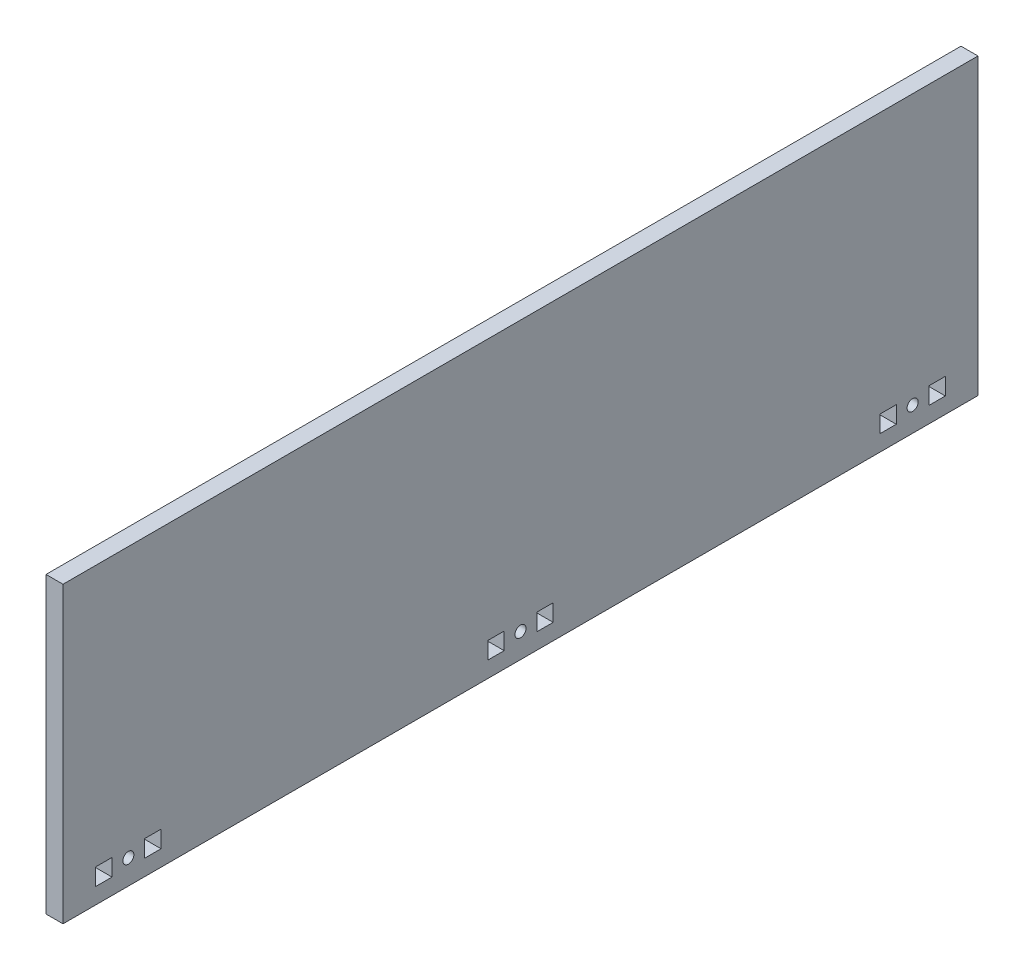
ISO-10303-21;
HEADER;
FILE_DESCRIPTION(('STEP AP214'),'2;1');
FILE_NAME('part.step','',(''),(''),'','','');
FILE_SCHEMA(('AUTOMOTIVE_DESIGN { 1 0 10303 214 1 1 1 1 }'));
ENDSEC;
DATA;
#1=APPLICATION_CONTEXT('core data for automotive mechanical design processes');
#2=APPLICATION_PROTOCOL_DEFINITION('international standard','automotive_design',2000,#1);
#3=PRODUCT_CONTEXT('',#1,'mechanical');
#4=PRODUCT('Part','Part','',(#3));
#5=PRODUCT_RELATED_PRODUCT_CATEGORY('part','',(#4));
#6=PRODUCT_DEFINITION_FORMATION('','',#4);
#7=PRODUCT_DEFINITION_CONTEXT('part definition',#1,'design');
#8=PRODUCT_DEFINITION('design','',#6,#7);
#9=PRODUCT_DEFINITION_SHAPE('','',#8);
#10=(LENGTH_UNIT() NAMED_UNIT(*) SI_UNIT(.MILLI.,.METRE.));
#11=(NAMED_UNIT(*) PLANE_ANGLE_UNIT() SI_UNIT($,.RADIAN.));
#12=(NAMED_UNIT(*) SI_UNIT($,.STERADIAN.) SOLID_ANGLE_UNIT());
#13=UNCERTAINTY_MEASURE_WITH_UNIT(LENGTH_MEASURE(1.E-05),#10,'distance_accuracy_value','');
#14=(GEOMETRIC_REPRESENTATION_CONTEXT(3) GLOBAL_UNCERTAINTY_ASSIGNED_CONTEXT((#13)) GLOBAL_UNIT_ASSIGNED_CONTEXT((#10,
#11,#12)) REPRESENTATION_CONTEXT('',''));
#15=CARTESIAN_POINT('',(0.,0.,0.));
#16=DIRECTION('',(0.,0.,1.));
#17=DIRECTION('',(1.,0.,0.));
#18=AXIS2_PLACEMENT_3D('',#15,#16,#17);
#19=CARTESIAN_POINT('',(6.604,0.,0.));
#20=DIRECTION('',(1.,0.,0.));
#21=DIRECTION('',(0.,0.,-1.));
#22=AXIS2_PLACEMENT_3D('',#19,#20,#21);
#23=PLANE('',#22);
#24=DIRECTION('',(0.,0.,-1.));
#25=VECTOR('',#24,1.);
#26=CARTESIAN_POINT('',(6.604,6.22300000000006,-146.05));
#27=LINE('',#26,#25);
#28=CARTESIAN_POINT('',(6.604,6.22300000000003,-139.7));
#29=VERTEX_POINT('',#28);
#30=CARTESIAN_POINT('',(6.604,6.22300000000006,-146.05));
#31=VERTEX_POINT('',#30);
#32=EDGE_CURVE('E289',#29,#31,#27,.T.);
#33=ORIENTED_EDGE('',*,*,#32,.F.);
#34=DIRECTION('',(0.,-1.,0.));
#35=VECTOR('',#34,1.);
#36=CARTESIAN_POINT('',(6.604,6.22300000000003,-139.7));
#37=LINE('',#36,#35);
#38=CARTESIAN_POINT('',(6.604,12.827,-139.7));
#39=VERTEX_POINT('',#38);
#40=EDGE_CURVE('E280',#39,#29,#37,.T.);
#41=ORIENTED_EDGE('',*,*,#40,.F.);
#42=DIRECTION('',(0.,0.,1.));
#43=VECTOR('',#42,1.);
#44=CARTESIAN_POINT('',(6.604,12.827,-139.7));
#45=LINE('',#44,#43);
#46=CARTESIAN_POINT('',(6.604,12.827,-146.05));
#47=VERTEX_POINT('',#46);
#48=EDGE_CURVE('E307',#47,#39,#45,.T.);
#49=ORIENTED_EDGE('',*,*,#48,.F.);
#50=DIRECTION('',(0.,1.,0.));
#51=VECTOR('',#50,1.);
#52=CARTESIAN_POINT('',(6.604,12.827,-146.05));
#53=LINE('',#52,#51);
#54=EDGE_CURVE('E303',#31,#47,#53,.T.);
#55=ORIENTED_EDGE('',*,*,#54,.F.);
#56=EDGE_LOOP('',(#33,#41,#49,#55));
#57=FACE_BOUND('',#56,.T.);
#58=CARTESIAN_POINT('',(6.604,9.52500000000002,-4.35415592470179E-13));
#59=DIRECTION('',(1.,0.,0.));
#60=DIRECTION('',(0.,0.,-1.));
#61=AXIS2_PLACEMENT_3D('',#58,#59,#60);
#62=CIRCLE('',#61,2.15265);
#63=CARTESIAN_POINT('',(6.604,9.52500000000002,-2.15265000000044));
#64=VERTEX_POINT('',#63);
#65=EDGE_CURVE('E374',#64,#64,#62,.T.);
#66=ORIENTED_EDGE('',*,*,#65,.F.);
#67=EDGE_LOOP('',(#66));
#68=FACE_BOUND('',#67,.T.);
#69=DIRECTION('',(0.,0.,-1.));
#70=VECTOR('',#69,1.);
#71=CARTESIAN_POINT('',(6.604,6.22300000000001,-12.7000000000004));
#72=LINE('',#71,#70);
#73=CARTESIAN_POINT('',(6.604,6.22299999999999,-6.35000000000046));
#74=VERTEX_POINT('',#73);
#75=CARTESIAN_POINT('',(6.604,6.22300000000001,-12.7000000000004));
#76=VERTEX_POINT('',#75);
#77=EDGE_CURVE('E428',#74,#76,#72,.T.);
#78=ORIENTED_EDGE('',*,*,#77,.F.);
#79=DIRECTION('',(0.,-1.,0.));
#80=VECTOR('',#79,1.);
#81=CARTESIAN_POINT('',(6.604,6.22299999999999,-6.35000000000046));
#82=LINE('',#81,#80);
#83=CARTESIAN_POINT('',(6.604,12.827,-6.3500000000003));
#84=VERTEX_POINT('',#83);
#85=EDGE_CURVE('E425',#84,#74,#82,.T.);
#86=ORIENTED_EDGE('',*,*,#85,.F.);
#87=DIRECTION('',(0.,0.,1.));
#88=VECTOR('',#87,1.);
#89=CARTESIAN_POINT('',(6.604,12.827,-6.3500000000003));
#90=LINE('',#89,#88);
#91=CARTESIAN_POINT('',(6.604,12.827,-12.7000000000005));
#92=VERTEX_POINT('',#91);
#93=EDGE_CURVE('E436',#92,#84,#90,.T.);
#94=ORIENTED_EDGE('',*,*,#93,.F.);
#95=DIRECTION('',(0.,1.,0.));
#96=VECTOR('',#95,1.);
#97=CARTESIAN_POINT('',(6.604,12.827,-12.7000000000005));
#98=LINE('',#97,#96);
#99=EDGE_CURVE('E432',#76,#92,#98,.T.);
#100=ORIENTED_EDGE('',*,*,#99,.F.);
#101=EDGE_LOOP('',(#78,#86,#94,#100));
#102=FACE_BOUND('',#101,.T.);
#103=DIRECTION('',(0.,0.,-1.));
#104=VECTOR('',#103,1.);
#105=CARTESIAN_POINT('',(6.604,6.22299999999999,158.749999999998));
#106=LINE('',#105,#104);
#107=CARTESIAN_POINT('',(6.604,6.22299999999996,165.099999999998));
#108=VERTEX_POINT('',#107);
#109=CARTESIAN_POINT('',(6.604,6.22299999999999,158.749999999998));
#110=VERTEX_POINT('',#109);
#111=EDGE_CURVE('E479',#108,#110,#106,.T.);
#112=ORIENTED_EDGE('',*,*,#111,.F.);
#113=DIRECTION('',(0.,-1.,0.));
#114=VECTOR('',#113,1.);
#115=CARTESIAN_POINT('',(6.604,6.22299999999996,165.099999999998));
#116=LINE('',#115,#114);
#117=CARTESIAN_POINT('',(6.604,12.827,165.099999999998));
#118=VERTEX_POINT('',#117);
#119=EDGE_CURVE('E476',#118,#108,#116,.T.);
#120=ORIENTED_EDGE('',*,*,#119,.F.);
#121=DIRECTION('',(0.,0.,1.));
#122=VECTOR('',#121,1.);
#123=CARTESIAN_POINT('',(6.604,12.827,165.099999999998));
#124=LINE('',#123,#122);
#125=CARTESIAN_POINT('',(6.604,12.827,158.749999999998));
#126=VERTEX_POINT('',#125);
#127=EDGE_CURVE('E487',#126,#118,#124,.T.);
#128=ORIENTED_EDGE('',*,*,#127,.F.);
#129=DIRECTION('',(0.,1.,0.));
#130=VECTOR('',#129,1.);
#131=CARTESIAN_POINT('',(6.604,12.827,158.749999999998));
#132=LINE('',#131,#130);
#133=EDGE_CURVE('E483',#110,#126,#132,.T.);
#134=ORIENTED_EDGE('',*,*,#133,.F.);
#135=EDGE_LOOP('',(#112,#120,#128,#134));
#136=FACE_BOUND('',#135,.T.);
#137=DIRECTION('',(0.,-1.,0.));
#138=VECTOR('',#137,1.);
#139=CARTESIAN_POINT('',(6.604,114.3,177.8));
#140=LINE('',#139,#138);
#141=CARTESIAN_POINT('',(6.604,114.3,177.8));
#142=VERTEX_POINT('',#141);
#143=CARTESIAN_POINT('',(6.604,0.,177.8));
#144=VERTEX_POINT('',#143);
#145=EDGE_CURVE('E562',#142,#144,#140,.T.);
#146=ORIENTED_EDGE('',*,*,#145,.T.);
#147=DIRECTION('',(0.,0.,-1.));
#148=VECTOR('',#147,1.);
#149=CARTESIAN_POINT('',(6.604,0.,177.8));
#150=LINE('',#149,#148);
#151=CARTESIAN_POINT('',(6.604,0.,-177.8));
#152=VERTEX_POINT('',#151);
#153=EDGE_CURVE('E566',#144,#152,#150,.T.);
#154=ORIENTED_EDGE('',*,*,#153,.T.);
#155=DIRECTION('',(0.,1.,0.));
#156=VECTOR('',#155,1.);
#157=CARTESIAN_POINT('',(6.604,114.3,-177.8));
#158=LINE('',#157,#156);
#159=CARTESIAN_POINT('',(6.604,114.3,-177.8));
#160=VERTEX_POINT('',#159);
#161=EDGE_CURVE('E570',#152,#160,#158,.T.);
#162=ORIENTED_EDGE('',*,*,#161,.T.);
#163=DIRECTION('',(0.,0.,1.));
#164=VECTOR('',#163,1.);
#165=CARTESIAN_POINT('',(6.604,114.3,177.8));
#166=LINE('',#165,#164);
#167=EDGE_CURVE('E573',#160,#142,#166,.T.);
#168=ORIENTED_EDGE('',*,*,#167,.T.);
#169=EDGE_LOOP('',(#146,#154,#162,#168));
#170=FACE_BOUND('',#169,.T.);
#171=DIRECTION('',(0.,0.,-1.));
#172=VECTOR('',#171,1.);
#173=CARTESIAN_POINT('',(6.604,6.22299999999999,139.699999999998));
#174=LINE('',#173,#172);
#175=CARTESIAN_POINT('',(6.604,6.22299999999997,146.049999999998));
#176=VERTEX_POINT('',#175);
#177=CARTESIAN_POINT('',(6.604,6.22299999999999,139.699999999998));
#178=VERTEX_POINT('',#177);
#179=EDGE_CURVE('E522',#176,#178,#174,.T.);
#180=ORIENTED_EDGE('',*,*,#179,.F.);
#181=DIRECTION('',(0.,-1.,0.));
#182=VECTOR('',#181,1.);
#183=CARTESIAN_POINT('',(6.604,6.22299999999997,146.049999999998));
#184=LINE('',#183,#182);
#185=CARTESIAN_POINT('',(6.604,12.827,146.049999999999));
#186=VERTEX_POINT('',#185);
#187=EDGE_CURVE('E519',#186,#176,#184,.T.);
#188=ORIENTED_EDGE('',*,*,#187,.F.);
#189=DIRECTION('',(0.,0.,1.));
#190=VECTOR('',#189,1.);
#191=CARTESIAN_POINT('',(6.604,12.827,146.049999999999));
#192=LINE('',#191,#190);
#193=CARTESIAN_POINT('',(6.604,12.827,139.699999999998));
#194=VERTEX_POINT('',#193);
#195=EDGE_CURVE('E530',#194,#186,#192,.T.);
#196=ORIENTED_EDGE('',*,*,#195,.F.);
#197=DIRECTION('',(0.,1.,0.));
#198=VECTOR('',#197,1.);
#199=CARTESIAN_POINT('',(6.604,12.827,139.699999999998));
#200=LINE('',#199,#198);
#201=EDGE_CURVE('E526',#178,#194,#200,.T.);
#202=ORIENTED_EDGE('',*,*,#201,.F.);
#203=EDGE_LOOP('',(#180,#188,#196,#202));
#204=FACE_BOUND('',#203,.T.);
#205=CARTESIAN_POINT('',(6.604,9.525,152.399999999998));
#206=DIRECTION('',(1.,0.,0.));
#207=DIRECTION('',(0.,0.,-1.));
#208=AXIS2_PLACEMENT_3D('',#205,#206,#207);
#209=CIRCLE('',#208,2.15265000000001);
#210=CARTESIAN_POINT('',(6.604,9.525,150.247349999998));
#211=VERTEX_POINT('',#210);
#212=EDGE_CURVE('E468',#211,#211,#209,.T.);
#213=ORIENTED_EDGE('',*,*,#212,.F.);
#214=EDGE_LOOP('',(#213));
#215=FACE_BOUND('',#214,.T.);
#216=DIRECTION('',(0.,0.,-1.));
#217=VECTOR('',#216,1.);
#218=CARTESIAN_POINT('',(6.604,6.22300000000001,6.34999999999959));
#219=LINE('',#218,#217);
#220=CARTESIAN_POINT('',(6.604,6.22299999999999,12.6999999999996));
#221=VERTEX_POINT('',#220);
#222=CARTESIAN_POINT('',(6.604,6.22300000000001,6.34999999999959));
#223=VERTEX_POINT('',#222);
#224=EDGE_CURVE('E385',#221,#223,#219,.T.);
#225=ORIENTED_EDGE('',*,*,#224,.F.);
#226=DIRECTION('',(0.,-1.,0.));
#227=VECTOR('',#226,1.);
#228=CARTESIAN_POINT('',(6.604,6.22299999999999,12.6999999999996));
#229=LINE('',#228,#227);
#230=CARTESIAN_POINT('',(6.604,12.827,12.6999999999995));
#231=VERTEX_POINT('',#230);
#232=EDGE_CURVE('E382',#231,#221,#229,.T.);
#233=ORIENTED_EDGE('',*,*,#232,.F.);
#234=DIRECTION('',(0.,0.,1.));
#235=VECTOR('',#234,1.);
#236=CARTESIAN_POINT('',(6.604,12.827,12.6999999999995));
#237=LINE('',#236,#235);
#238=CARTESIAN_POINT('',(6.604,12.827,6.34999999999945));
#239=VERTEX_POINT('',#238);
#240=EDGE_CURVE('E393',#239,#231,#237,.T.);
#241=ORIENTED_EDGE('',*,*,#240,.F.);
#242=DIRECTION('',(0.,1.,0.));
#243=VECTOR('',#242,1.);
#244=CARTESIAN_POINT('',(6.604,12.827,6.34999999999945));
#245=LINE('',#244,#243);
#246=EDGE_CURVE('E389',#223,#239,#245,.T.);
#247=ORIENTED_EDGE('',*,*,#246,.F.);
#248=EDGE_LOOP('',(#225,#233,#241,#247));
#249=FACE_BOUND('',#248,.T.);
#250=DIRECTION('',(0.,0.,-1.));
#251=VECTOR('',#250,1.);
#252=CARTESIAN_POINT('',(6.604,6.22300000000006,-165.1));
#253=LINE('',#252,#251);
#254=CARTESIAN_POINT('',(6.604,6.22300000000004,-158.75));
#255=VERTEX_POINT('',#254);
#256=CARTESIAN_POINT('',(6.604,6.22300000000006,-165.1));
#257=VERTEX_POINT('',#256);
#258=EDGE_CURVE('E334',#255,#257,#253,.T.);
#259=ORIENTED_EDGE('',*,*,#258,.F.);
#260=DIRECTION('',(0.,-1.,0.));
#261=VECTOR('',#260,1.);
#262=CARTESIAN_POINT('',(6.604,6.22300000000004,-158.75));
#263=LINE('',#262,#261);
#264=CARTESIAN_POINT('',(6.604,12.827,-158.75));
#265=VERTEX_POINT('',#264);
#266=EDGE_CURVE('E331',#265,#255,#263,.T.);
#267=ORIENTED_EDGE('',*,*,#266,.F.);
#268=DIRECTION('',(0.,0.,1.));
#269=VECTOR('',#268,1.);
#270=CARTESIAN_POINT('',(6.604,12.827,-158.75));
#271=LINE('',#270,#269);
#272=CARTESIAN_POINT('',(6.604,12.827,-165.1));
#273=VERTEX_POINT('',#272);
#274=EDGE_CURVE('E342',#273,#265,#271,.T.);
#275=ORIENTED_EDGE('',*,*,#274,.F.);
#276=DIRECTION('',(0.,1.,0.));
#277=VECTOR('',#276,1.);
#278=CARTESIAN_POINT('',(6.604,12.827,-165.1));
#279=LINE('',#278,#277);
#280=EDGE_CURVE('E338',#257,#273,#279,.T.);
#281=ORIENTED_EDGE('',*,*,#280,.F.);
#282=EDGE_LOOP('',(#259,#267,#275,#281));
#283=FACE_BOUND('',#282,.T.);
#284=CARTESIAN_POINT('',(6.604,9.52500000000006,-152.4));
#285=DIRECTION('',(1.,0.,0.));
#286=DIRECTION('',(0.,0.,-1.));
#287=AXIS2_PLACEMENT_3D('',#284,#285,#286);
#288=CIRCLE('',#287,2.15265000000001);
#289=CARTESIAN_POINT('',(6.604,9.52500000000006,-154.55265));
#290=VERTEX_POINT('',#289);
#291=EDGE_CURVE('E315',#290,#290,#288,.T.);
#292=ORIENTED_EDGE('',*,*,#291,.F.);
#293=EDGE_LOOP('',(#292));
#294=FACE_BOUND('',#293,.T.);
#295=ADVANCED_FACE('F39',(#57,#68,#102,#136,#170,#204,#215,#249,#283,#294),#23,.T.);
#296=CARTESIAN_POINT('',(0.,0.,0.));
#297=DIRECTION('',(1.,0.,0.));
#298=DIRECTION('',(0.,0.,-1.));
#299=AXIS2_PLACEMENT_3D('',#296,#297,#298);
#300=PLANE('',#299);
#301=DIRECTION('',(0.,-1.,0.));
#302=VECTOR('',#301,1.);
#303=CARTESIAN_POINT('',(0.,6.22300000000003,-139.7));
#304=LINE('',#303,#302);
#305=CARTESIAN_POINT('',(0.,12.827,-139.7));
#306=VERTEX_POINT('',#305);
#307=CARTESIAN_POINT('',(0.,6.22300000000003,-139.7));
#308=VERTEX_POINT('',#307);
#309=EDGE_CURVE('E69',#306,#308,#304,.T.);
#310=ORIENTED_EDGE('',*,*,#309,.T.);
#311=DIRECTION('',(0.,0.,-1.));
#312=VECTOR('',#311,1.);
#313=CARTESIAN_POINT('',(0.,6.22300000000006,-146.05));
#314=LINE('',#313,#312);
#315=CARTESIAN_POINT('',(0.,6.22300000000006,-146.05));
#316=VERTEX_POINT('',#315);
#317=EDGE_CURVE('E296',#308,#316,#314,.T.);
#318=ORIENTED_EDGE('',*,*,#317,.T.);
#319=DIRECTION('',(0.,1.,0.));
#320=VECTOR('',#319,1.);
#321=CARTESIAN_POINT('',(0.,12.827,-146.05));
#322=LINE('',#321,#320);
#323=CARTESIAN_POINT('',(0.,12.827,-146.05));
#324=VERTEX_POINT('',#323);
#325=EDGE_CURVE('E318',#316,#324,#322,.T.);
#326=ORIENTED_EDGE('',*,*,#325,.T.);
#327=DIRECTION('',(0.,0.,1.));
#328=VECTOR('',#327,1.);
#329=CARTESIAN_POINT('',(0.,12.827,-139.7));
#330=LINE('',#329,#328);
#331=EDGE_CURVE('E290',#324,#306,#330,.T.);
#332=ORIENTED_EDGE('',*,*,#331,.T.);
#333=EDGE_LOOP('',(#310,#318,#326,#332));
#334=FACE_BOUND('',#333,.T.);
#335=CARTESIAN_POINT('',(0.,9.52500000000002,-4.35415592470179E-13));
#336=DIRECTION('',(1.,0.,0.));
#337=DIRECTION('',(0.,0.,-1.));
#338=AXIS2_PLACEMENT_3D('',#335,#336,#337);
#339=CIRCLE('',#338,2.15265);
#340=CARTESIAN_POINT('',(0.,9.52500000000002,-2.15265000000044));
#341=VERTEX_POINT('',#340);
#342=EDGE_CURVE('E373',#341,#341,#339,.T.);
#343=ORIENTED_EDGE('',*,*,#342,.T.);
#344=EDGE_LOOP('',(#343));
#345=FACE_BOUND('',#344,.T.);
#346=DIRECTION('',(0.,-1.,0.));
#347=VECTOR('',#346,1.);
#348=CARTESIAN_POINT('',(0.,6.22299999999999,-6.35000000000046));
#349=LINE('',#348,#347);
#350=CARTESIAN_POINT('',(0.,12.827,-6.3500000000003));
#351=VERTEX_POINT('',#350);
#352=CARTESIAN_POINT('',(0.,6.22299999999999,-6.35000000000046));
#353=VERTEX_POINT('',#352);
#354=EDGE_CURVE('E424',#351,#353,#349,.T.);
#355=ORIENTED_EDGE('',*,*,#354,.T.);
#356=DIRECTION('',(0.,0.,-1.));
#357=VECTOR('',#356,1.);
#358=CARTESIAN_POINT('',(0.,6.22300000000001,-12.7000000000004));
#359=LINE('',#358,#357);
#360=CARTESIAN_POINT('',(0.,6.22300000000001,-12.7000000000004));
#361=VERTEX_POINT('',#360);
#362=EDGE_CURVE('E443',#353,#361,#359,.T.);
#363=ORIENTED_EDGE('',*,*,#362,.T.);
#364=DIRECTION('',(0.,1.,0.));
#365=VECTOR('',#364,1.);
#366=CARTESIAN_POINT('',(0.,12.827,-12.7000000000005));
#367=LINE('',#366,#365);
#368=CARTESIAN_POINT('',(0.,12.827,-12.7000000000005));
#369=VERTEX_POINT('',#368);
#370=EDGE_CURVE('E447',#361,#369,#367,.T.);
#371=ORIENTED_EDGE('',*,*,#370,.T.);
#372=DIRECTION('',(0.,0.,1.));
#373=VECTOR('',#372,1.);
#374=CARTESIAN_POINT('',(0.,12.827,-6.3500000000003));
#375=LINE('',#374,#373);
#376=EDGE_CURVE('E429',#369,#351,#375,.T.);
#377=ORIENTED_EDGE('',*,*,#376,.T.);
#378=EDGE_LOOP('',(#355,#363,#371,#377));
#379=FACE_BOUND('',#378,.T.);
#380=DIRECTION('',(0.,-1.,0.));
#381=VECTOR('',#380,1.);
#382=CARTESIAN_POINT('',(0.,6.22299999999996,165.099999999998));
#383=LINE('',#382,#381);
#384=CARTESIAN_POINT('',(0.,12.827,165.099999999998));
#385=VERTEX_POINT('',#384);
#386=CARTESIAN_POINT('',(0.,6.22299999999996,165.099999999998));
#387=VERTEX_POINT('',#386);
#388=EDGE_CURVE('E472',#385,#387,#383,.T.);
#389=ORIENTED_EDGE('',*,*,#388,.T.);
#390=DIRECTION('',(0.,0.,-1.));
#391=VECTOR('',#390,1.);
#392=CARTESIAN_POINT('',(0.,6.22299999999999,158.749999999998));
#393=LINE('',#392,#391);
#394=CARTESIAN_POINT('',(0.,6.22299999999999,158.749999999998));
#395=VERTEX_POINT('',#394);
#396=EDGE_CURVE('E494',#387,#395,#393,.T.);
#397=ORIENTED_EDGE('',*,*,#396,.T.);
#398=DIRECTION('',(0.,1.,0.));
#399=VECTOR('',#398,1.);
#400=CARTESIAN_POINT('',(0.,12.827,158.749999999998));
#401=LINE('',#400,#399);
#402=CARTESIAN_POINT('',(0.,12.827,158.749999999998));
#403=VERTEX_POINT('',#402);
#404=EDGE_CURVE('E498',#395,#403,#401,.T.);
#405=ORIENTED_EDGE('',*,*,#404,.T.);
#406=DIRECTION('',(0.,0.,1.));
#407=VECTOR('',#406,1.);
#408=CARTESIAN_POINT('',(0.,12.827,165.099999999998));
#409=LINE('',#408,#407);
#410=EDGE_CURVE('E480',#403,#385,#409,.T.);
#411=ORIENTED_EDGE('',*,*,#410,.T.);
#412=EDGE_LOOP('',(#389,#397,#405,#411));
#413=FACE_BOUND('',#412,.T.);
#414=DIRECTION('',(0.,-1.,0.));
#415=VECTOR('',#414,1.);
#416=CARTESIAN_POINT('',(0.,114.3,177.8));
#417=LINE('',#416,#415);
#418=CARTESIAN_POINT('',(0.,114.3,177.8));
#419=VERTEX_POINT('',#418);
#420=CARTESIAN_POINT('',(0.,0.,177.8));
#421=VERTEX_POINT('',#420);
#422=EDGE_CURVE('E561',#419,#421,#417,.T.);
#423=ORIENTED_EDGE('',*,*,#422,.F.);
#424=DIRECTION('',(0.,0.,1.));
#425=VECTOR('',#424,1.);
#426=CARTESIAN_POINT('',(0.,114.3,177.8));
#427=LINE('',#426,#425);
#428=CARTESIAN_POINT('',(0.,114.3,-177.8));
#429=VERTEX_POINT('',#428);
#430=EDGE_CURVE('E567',#429,#419,#427,.T.);
#431=ORIENTED_EDGE('',*,*,#430,.F.);
#432=DIRECTION('',(0.,1.,0.));
#433=VECTOR('',#432,1.);
#434=CARTESIAN_POINT('',(0.,114.3,-177.8));
#435=LINE('',#434,#433);
#436=CARTESIAN_POINT('',(0.,0.,-177.8));
#437=VERTEX_POINT('',#436);
#438=EDGE_CURVE('E583',#437,#429,#435,.T.);
#439=ORIENTED_EDGE('',*,*,#438,.F.);
#440=DIRECTION('',(0.,0.,-1.));
#441=VECTOR('',#440,1.);
#442=CARTESIAN_POINT('',(0.,0.,177.8));
#443=LINE('',#442,#441);
#444=EDGE_CURVE('E580',#421,#437,#443,.T.);
#445=ORIENTED_EDGE('',*,*,#444,.F.);
#446=EDGE_LOOP('',(#423,#431,#439,#445));
#447=FACE_BOUND('',#446,.T.);
#448=DIRECTION('',(0.,-1.,0.));
#449=VECTOR('',#448,1.);
#450=CARTESIAN_POINT('',(0.,6.22299999999997,146.049999999998));
#451=LINE('',#450,#449);
#452=CARTESIAN_POINT('',(0.,12.827,146.049999999999));
#453=VERTEX_POINT('',#452);
#454=CARTESIAN_POINT('',(0.,6.22299999999997,146.049999999998));
#455=VERTEX_POINT('',#454);
#456=EDGE_CURVE('E518',#453,#455,#451,.T.);
#457=ORIENTED_EDGE('',*,*,#456,.T.);
#458=DIRECTION('',(0.,0.,-1.));
#459=VECTOR('',#458,1.);
#460=CARTESIAN_POINT('',(0.,6.22299999999999,139.699999999998));
#461=LINE('',#460,#459);
#462=CARTESIAN_POINT('',(0.,6.22299999999999,139.699999999998));
#463=VERTEX_POINT('',#462);
#464=EDGE_CURVE('E537',#455,#463,#461,.T.);
#465=ORIENTED_EDGE('',*,*,#464,.T.);
#466=DIRECTION('',(0.,1.,0.));
#467=VECTOR('',#466,1.);
#468=CARTESIAN_POINT('',(0.,12.827,139.699999999998));
#469=LINE('',#468,#467);
#470=CARTESIAN_POINT('',(0.,12.827,139.699999999998));
#471=VERTEX_POINT('',#470);
#472=EDGE_CURVE('E541',#463,#471,#469,.T.);
#473=ORIENTED_EDGE('',*,*,#472,.T.);
#474=DIRECTION('',(0.,0.,1.));
#475=VECTOR('',#474,1.);
#476=CARTESIAN_POINT('',(0.,12.827,146.049999999999));
#477=LINE('',#476,#475);
#478=EDGE_CURVE('E523',#471,#453,#477,.T.);
#479=ORIENTED_EDGE('',*,*,#478,.T.);
#480=EDGE_LOOP('',(#457,#465,#473,#479));
#481=FACE_BOUND('',#480,.T.);
#482=CARTESIAN_POINT('',(0.,9.525,152.399999999998));
#483=DIRECTION('',(1.,0.,0.));
#484=DIRECTION('',(0.,0.,-1.));
#485=AXIS2_PLACEMENT_3D('',#482,#483,#484);
#486=CIRCLE('',#485,2.15265000000001);
#487=CARTESIAN_POINT('',(0.,9.525,150.247349999998));
#488=VERTEX_POINT('',#487);
#489=EDGE_CURVE('E467',#488,#488,#486,.T.);
#490=ORIENTED_EDGE('',*,*,#489,.T.);
#491=EDGE_LOOP('',(#490));
#492=FACE_BOUND('',#491,.T.);
#493=DIRECTION('',(0.,-1.,0.));
#494=VECTOR('',#493,1.);
#495=CARTESIAN_POINT('',(0.,6.22299999999999,12.6999999999996));
#496=LINE('',#495,#494);
#497=CARTESIAN_POINT('',(0.,12.827,12.6999999999995));
#498=VERTEX_POINT('',#497);
#499=CARTESIAN_POINT('',(0.,6.22299999999999,12.6999999999996));
#500=VERTEX_POINT('',#499);
#501=EDGE_CURVE('E378',#498,#500,#496,.T.);
#502=ORIENTED_EDGE('',*,*,#501,.T.);
#503=DIRECTION('',(0.,0.,-1.));
#504=VECTOR('',#503,1.);
#505=CARTESIAN_POINT('',(0.,6.22300000000001,6.34999999999959));
#506=LINE('',#505,#504);
#507=CARTESIAN_POINT('',(0.,6.22300000000001,6.34999999999959));
#508=VERTEX_POINT('',#507);
#509=EDGE_CURVE('E400',#500,#508,#506,.T.);
#510=ORIENTED_EDGE('',*,*,#509,.T.);
#511=DIRECTION('',(0.,1.,0.));
#512=VECTOR('',#511,1.);
#513=CARTESIAN_POINT('',(0.,12.827,6.34999999999945));
#514=LINE('',#513,#512);
#515=CARTESIAN_POINT('',(0.,12.827,6.34999999999945));
#516=VERTEX_POINT('',#515);
#517=EDGE_CURVE('E404',#508,#516,#514,.T.);
#518=ORIENTED_EDGE('',*,*,#517,.T.);
#519=DIRECTION('',(0.,0.,1.));
#520=VECTOR('',#519,1.);
#521=CARTESIAN_POINT('',(0.,12.827,12.6999999999995));
#522=LINE('',#521,#520);
#523=EDGE_CURVE('E386',#516,#498,#522,.T.);
#524=ORIENTED_EDGE('',*,*,#523,.T.);
#525=EDGE_LOOP('',(#502,#510,#518,#524));
#526=FACE_BOUND('',#525,.T.);
#527=DIRECTION('',(0.,-1.,0.));
#528=VECTOR('',#527,1.);
#529=CARTESIAN_POINT('',(0.,6.22300000000004,-158.75));
#530=LINE('',#529,#528);
#531=CARTESIAN_POINT('',(0.,12.827,-158.75));
#532=VERTEX_POINT('',#531);
#533=CARTESIAN_POINT('',(0.,6.22300000000004,-158.75));
#534=VERTEX_POINT('',#533);
#535=EDGE_CURVE('E298',#532,#534,#530,.T.);
#536=ORIENTED_EDGE('',*,*,#535,.T.);
#537=DIRECTION('',(0.,0.,-1.));
#538=VECTOR('',#537,1.);
#539=CARTESIAN_POINT('',(0.,6.22300000000006,-165.1));
#540=LINE('',#539,#538);
#541=CARTESIAN_POINT('',(0.,6.22300000000006,-165.1));
#542=VERTEX_POINT('',#541);
#543=EDGE_CURVE('E349',#534,#542,#540,.T.);
#544=ORIENTED_EDGE('',*,*,#543,.T.);
#545=DIRECTION('',(0.,1.,0.));
#546=VECTOR('',#545,1.);
#547=CARTESIAN_POINT('',(0.,12.827,-165.1));
#548=LINE('',#547,#546);
#549=CARTESIAN_POINT('',(0.,12.827,-165.1));
#550=VERTEX_POINT('',#549);
#551=EDGE_CURVE('E353',#542,#550,#548,.T.);
#552=ORIENTED_EDGE('',*,*,#551,.T.);
#553=DIRECTION('',(0.,0.,1.));
#554=VECTOR('',#553,1.);
#555=CARTESIAN_POINT('',(0.,12.827,-158.75));
#556=LINE('',#555,#554);
#557=EDGE_CURVE('E335',#550,#532,#556,.T.);
#558=ORIENTED_EDGE('',*,*,#557,.T.);
#559=EDGE_LOOP('',(#536,#544,#552,#558));
#560=FACE_BOUND('',#559,.T.);
#561=CARTESIAN_POINT('',(0.,9.52500000000006,-152.4));
#562=DIRECTION('',(1.,0.,0.));
#563=DIRECTION('',(0.,0.,-1.));
#564=AXIS2_PLACEMENT_3D('',#561,#562,#563);
#565=CIRCLE('',#564,2.15265000000001);
#566=CARTESIAN_POINT('',(0.,9.52500000000006,-154.55265));
#567=VERTEX_POINT('',#566);
#568=EDGE_CURVE('E674',#567,#567,#565,.T.);
#569=ORIENTED_EDGE('',*,*,#568,.T.);
#570=EDGE_LOOP('',(#569));
#571=FACE_BOUND('',#570,.T.);
#572=ADVANCED_FACE('F606',(#334,#345,#379,#413,#447,#481,#492,#526,#560,#571),#300,.F.);
#573=CARTESIAN_POINT('',(6.604,114.3,177.8));
#574=DIRECTION('',(0.,0.,-1.));
#575=DIRECTION('',(-1.,0.,0.));
#576=AXIS2_PLACEMENT_3D('',#573,#574,#575);
#577=PLANE('',#576);
#578=ORIENTED_EDGE('',*,*,#422,.T.);
#579=DIRECTION('',(-1.,0.,0.));
#580=VECTOR('',#579,1.);
#581=CARTESIAN_POINT('',(6.604,0.,177.8));
#582=LINE('',#581,#580);
#583=EDGE_CURVE('E11',#144,#421,#582,.T.);
#584=ORIENTED_EDGE('',*,*,#583,.F.);
#585=ORIENTED_EDGE('',*,*,#145,.F.);
#586=DIRECTION('',(-1.,0.,0.));
#587=VECTOR('',#586,1.);
#588=CARTESIAN_POINT('',(6.604,114.3,177.8));
#589=LINE('',#588,#587);
#590=EDGE_CURVE('E576',#142,#419,#589,.T.);
#591=ORIENTED_EDGE('',*,*,#590,.T.);
#592=EDGE_LOOP('',(#578,#584,#585,#591));
#593=FACE_BOUND('',#592,.T.);
#594=ADVANCED_FACE('F41',(#593),#577,.F.);
#595=CARTESIAN_POINT('',(6.604,0.,177.8));
#596=DIRECTION('',(0.,1.,0.));
#597=DIRECTION('',(0.,0.,1.));
#598=AXIS2_PLACEMENT_3D('',#595,#596,#597);
#599=PLANE('',#598);
#600=ORIENTED_EDGE('',*,*,#444,.T.);
#601=DIRECTION('',(-1.,0.,0.));
#602=VECTOR('',#601,1.);
#603=CARTESIAN_POINT('',(6.604,0.,-177.8));
#604=LINE('',#603,#602);
#605=EDGE_CURVE('E48',#152,#437,#604,.T.);
#606=ORIENTED_EDGE('',*,*,#605,.F.);
#607=ORIENTED_EDGE('',*,*,#153,.F.);
#608=ORIENTED_EDGE('',*,*,#583,.T.);
#609=EDGE_LOOP('',(#600,#606,#607,#608));
#610=FACE_BOUND('',#609,.T.);
#611=ADVANCED_FACE('F617',(#610),#599,.F.);
#612=CARTESIAN_POINT('',(6.604,114.3,-177.8));
#613=DIRECTION('',(0.,0.,1.));
#614=DIRECTION('',(1.,0.,0.));
#615=AXIS2_PLACEMENT_3D('',#612,#613,#614);
#616=PLANE('',#615);
#617=ORIENTED_EDGE('',*,*,#438,.T.);
#618=DIRECTION('',(-1.,0.,0.));
#619=VECTOR('',#618,1.);
#620=CARTESIAN_POINT('',(6.604,114.3,-177.8));
#621=LINE('',#620,#619);
#622=EDGE_CURVE('E591',#160,#429,#621,.T.);
#623=ORIENTED_EDGE('',*,*,#622,.F.);
#624=ORIENTED_EDGE('',*,*,#161,.F.);
#625=ORIENTED_EDGE('',*,*,#605,.T.);
#626=EDGE_LOOP('',(#617,#623,#624,#625));
#627=FACE_BOUND('',#626,.T.);
#628=ADVANCED_FACE('F600',(#627),#616,.F.);
#629=CARTESIAN_POINT('',(6.604,114.3,177.8));
#630=DIRECTION('',(0.,-1.,0.));
#631=DIRECTION('',(0.,0.,-1.));
#632=AXIS2_PLACEMENT_3D('',#629,#630,#631);
#633=PLANE('',#632);
#634=ORIENTED_EDGE('',*,*,#430,.T.);
#635=ORIENTED_EDGE('',*,*,#590,.F.);
#636=ORIENTED_EDGE('',*,*,#167,.F.);
#637=ORIENTED_EDGE('',*,*,#622,.T.);
#638=EDGE_LOOP('',(#634,#635,#636,#637));
#639=FACE_BOUND('',#638,.T.);
#640=ADVANCED_FACE('F610',(#639),#633,.F.);
#641=CARTESIAN_POINT('',(6.604,6.22299999999997,146.049999999998));
#642=DIRECTION('',(0.,0.,-1.));
#643=DIRECTION('',(0.,1.,0.));
#644=AXIS2_PLACEMENT_3D('',#641,#642,#643);
#645=PLANE('',#644);
#646=ORIENTED_EDGE('',*,*,#456,.F.);
#647=DIRECTION('',(-1.,0.,0.));
#648=VECTOR('',#647,1.);
#649=CARTESIAN_POINT('',(6.604,12.827,146.049999999999));
#650=LINE('',#649,#648);
#651=EDGE_CURVE('E533',#186,#453,#650,.T.);
#652=ORIENTED_EDGE('',*,*,#651,.F.);
#653=ORIENTED_EDGE('',*,*,#187,.T.);
#654=DIRECTION('',(-1.,0.,0.));
#655=VECTOR('',#654,1.);
#656=CARTESIAN_POINT('',(6.604,6.22299999999997,146.049999999998));
#657=LINE('',#656,#655);
#658=EDGE_CURVE('E557',#176,#455,#657,.T.);
#659=ORIENTED_EDGE('',*,*,#658,.T.);
#660=EDGE_LOOP('',(#646,#652,#653,#659));
#661=FACE_BOUND('',#660,.T.);
#662=ADVANCED_FACE('F632',(#661),#645,.T.);
#663=CARTESIAN_POINT('',(6.604,6.22299999999999,139.699999999998));
#664=DIRECTION('',(0.,1.,0.));
#665=DIRECTION('',(0.,0.,1.));
#666=AXIS2_PLACEMENT_3D('',#663,#664,#665);
#667=PLANE('',#666);
#668=ORIENTED_EDGE('',*,*,#464,.F.);
#669=ORIENTED_EDGE('',*,*,#658,.F.);
#670=ORIENTED_EDGE('',*,*,#179,.T.);
#671=DIRECTION('',(-1.,0.,0.));
#672=VECTOR('',#671,1.);
#673=CARTESIAN_POINT('',(6.604,6.22299999999999,139.699999999998));
#674=LINE('',#673,#672);
#675=EDGE_CURVE('E554',#178,#463,#674,.T.);
#676=ORIENTED_EDGE('',*,*,#675,.T.);
#677=EDGE_LOOP('',(#668,#669,#670,#676));
#678=FACE_BOUND('',#677,.T.);
#679=ADVANCED_FACE('F639',(#678),#667,.T.);
#680=CARTESIAN_POINT('',(6.604,12.827,139.699999999998));
#681=DIRECTION('',(0.,0.,1.));
#682=DIRECTION('',(1.,0.,0.));
#683=AXIS2_PLACEMENT_3D('',#680,#681,#682);
#684=PLANE('',#683);
#685=ORIENTED_EDGE('',*,*,#472,.F.);
#686=ORIENTED_EDGE('',*,*,#675,.F.);
#687=ORIENTED_EDGE('',*,*,#201,.T.);
#688=DIRECTION('',(-1.,0.,0.));
#689=VECTOR('',#688,1.);
#690=CARTESIAN_POINT('',(6.604,12.827,139.699999999998));
#691=LINE('',#690,#689);
#692=EDGE_CURVE('E551',#194,#471,#691,.T.);
#693=ORIENTED_EDGE('',*,*,#692,.T.);
#694=EDGE_LOOP('',(#685,#686,#687,#693));
#695=FACE_BOUND('',#694,.T.);
#696=ADVANCED_FACE('F644',(#695),#684,.T.);
#697=CARTESIAN_POINT('',(6.604,12.827,146.049999999999));
#698=DIRECTION('',(0.,-1.,0.));
#699=DIRECTION('',(0.,0.,-1.));
#700=AXIS2_PLACEMENT_3D('',#697,#698,#699);
#701=PLANE('',#700);
#702=ORIENTED_EDGE('',*,*,#478,.F.);
#703=ORIENTED_EDGE('',*,*,#692,.F.);
#704=ORIENTED_EDGE('',*,*,#195,.T.);
#705=ORIENTED_EDGE('',*,*,#651,.T.);
#706=EDGE_LOOP('',(#702,#703,#704,#705));
#707=FACE_BOUND('',#706,.T.);
#708=ADVANCED_FACE('F651',(#707),#701,.T.);
#709=CARTESIAN_POINT('',(6.604,6.22299999999996,165.099999999998));
#710=DIRECTION('',(0.,0.,-1.));
#711=DIRECTION('',(0.,1.,0.));
#712=AXIS2_PLACEMENT_3D('',#709,#710,#711);
#713=PLANE('',#712);
#714=ORIENTED_EDGE('',*,*,#388,.F.);
#715=DIRECTION('',(-1.,0.,0.));
#716=VECTOR('',#715,1.);
#717=CARTESIAN_POINT('',(6.604,12.827,165.099999999998));
#718=LINE('',#717,#716);
#719=EDGE_CURVE('E490',#118,#385,#718,.T.);
#720=ORIENTED_EDGE('',*,*,#719,.F.);
#721=ORIENTED_EDGE('',*,*,#119,.T.);
#722=DIRECTION('',(-1.,0.,0.));
#723=VECTOR('',#722,1.);
#724=CARTESIAN_POINT('',(6.604,6.22299999999996,165.099999999998));
#725=LINE('',#724,#723);
#726=EDGE_CURVE('E514',#108,#387,#725,.T.);
#727=ORIENTED_EDGE('',*,*,#726,.T.);
#728=EDGE_LOOP('',(#714,#720,#721,#727));
#729=FACE_BOUND('',#728,.T.);
#730=ADVANCED_FACE('F765',(#729),#713,.T.);
#731=CARTESIAN_POINT('',(6.604,6.22299999999999,158.749999999998));
#732=DIRECTION('',(0.,1.,0.));
#733=DIRECTION('',(0.,0.,1.));
#734=AXIS2_PLACEMENT_3D('',#731,#732,#733);
#735=PLANE('',#734);
#736=ORIENTED_EDGE('',*,*,#396,.F.);
#737=ORIENTED_EDGE('',*,*,#726,.F.);
#738=ORIENTED_EDGE('',*,*,#111,.T.);
#739=DIRECTION('',(-1.,0.,0.));
#740=VECTOR('',#739,1.);
#741=CARTESIAN_POINT('',(6.604,6.22299999999999,158.749999999998));
#742=LINE('',#741,#740);
#743=EDGE_CURVE('E511',#110,#395,#742,.T.);
#744=ORIENTED_EDGE('',*,*,#743,.T.);
#745=EDGE_LOOP('',(#736,#737,#738,#744));
#746=FACE_BOUND('',#745,.T.);
#747=ADVANCED_FACE('F761',(#746),#735,.T.);
#748=CARTESIAN_POINT('',(6.604,12.827,158.749999999998));
#749=DIRECTION('',(0.,0.,1.));
#750=DIRECTION('',(0.,-1.,0.));
#751=AXIS2_PLACEMENT_3D('',#748,#749,#750);
#752=PLANE('',#751);
#753=ORIENTED_EDGE('',*,*,#404,.F.);
#754=ORIENTED_EDGE('',*,*,#743,.F.);
#755=ORIENTED_EDGE('',*,*,#133,.T.);
#756=DIRECTION('',(-1.,0.,0.));
#757=VECTOR('',#756,1.);
#758=CARTESIAN_POINT('',(6.604,12.827,158.749999999998));
#759=LINE('',#758,#757);
#760=EDGE_CURVE('E508',#126,#403,#759,.T.);
#761=ORIENTED_EDGE('',*,*,#760,.T.);
#762=EDGE_LOOP('',(#753,#754,#755,#761));
#763=FACE_BOUND('',#762,.T.);
#764=ADVANCED_FACE('F757',(#763),#752,.T.);
#765=CARTESIAN_POINT('',(6.604,12.827,165.099999999998));
#766=DIRECTION('',(0.,-1.,0.));
#767=DIRECTION('',(0.,0.,-1.));
#768=AXIS2_PLACEMENT_3D('',#765,#766,#767);
#769=PLANE('',#768);
#770=ORIENTED_EDGE('',*,*,#410,.F.);
#771=ORIENTED_EDGE('',*,*,#760,.F.);
#772=ORIENTED_EDGE('',*,*,#127,.T.);
#773=ORIENTED_EDGE('',*,*,#719,.T.);
#774=EDGE_LOOP('',(#770,#771,#772,#773));
#775=FACE_BOUND('',#774,.T.);
#776=ADVANCED_FACE('F753',(#775),#769,.T.);
#777=CARTESIAN_POINT('',(6.604,9.525,152.399999999998));
#778=DIRECTION('',(-1.,0.,0.));
#779=DIRECTION('',(0.,0.,1.));
#780=AXIS2_PLACEMENT_3D('',#777,#778,#779);
#781=CYLINDRICAL_SURFACE('',#780,2.15265000000001);
#782=ORIENTED_EDGE('',*,*,#212,.T.);
#783=EDGE_LOOP('',(#782));
#784=FACE_BOUND('',#783,.T.);
#785=ORIENTED_EDGE('',*,*,#489,.F.);
#786=EDGE_LOOP('',(#785));
#787=FACE_BOUND('',#786,.T.);
#788=ADVANCED_FACE('F749',(#784,#787),#781,.F.);
#789=CARTESIAN_POINT('',(6.604,6.22299999999999,-6.35000000000046));
#790=DIRECTION('',(0.,0.,-1.));
#791=DIRECTION('',(0.,1.,0.));
#792=AXIS2_PLACEMENT_3D('',#789,#790,#791);
#793=PLANE('',#792);
#794=ORIENTED_EDGE('',*,*,#354,.F.);
#795=DIRECTION('',(-1.,0.,0.));
#796=VECTOR('',#795,1.);
#797=CARTESIAN_POINT('',(6.604,12.827,-6.3500000000003));
#798=LINE('',#797,#796);
#799=EDGE_CURVE('E439',#84,#351,#798,.T.);
#800=ORIENTED_EDGE('',*,*,#799,.F.);
#801=ORIENTED_EDGE('',*,*,#85,.T.);
#802=DIRECTION('',(-1.,0.,0.));
#803=VECTOR('',#802,1.);
#804=CARTESIAN_POINT('',(6.604,6.22299999999999,-6.35000000000046));
#805=LINE('',#804,#803);
#806=EDGE_CURVE('E463',#74,#353,#805,.T.);
#807=ORIENTED_EDGE('',*,*,#806,.T.);
#808=EDGE_LOOP('',(#794,#800,#801,#807));
#809=FACE_BOUND('',#808,.T.);
#810=ADVANCED_FACE('F745',(#809),#793,.T.);
#811=CARTESIAN_POINT('',(6.604,6.22300000000001,-12.7000000000004));
#812=DIRECTION('',(0.,1.,0.));
#813=DIRECTION('',(0.,0.,1.));
#814=AXIS2_PLACEMENT_3D('',#811,#812,#813);
#815=PLANE('',#814);
#816=ORIENTED_EDGE('',*,*,#362,.F.);
#817=ORIENTED_EDGE('',*,*,#806,.F.);
#818=ORIENTED_EDGE('',*,*,#77,.T.);
#819=DIRECTION('',(-1.,0.,0.));
#820=VECTOR('',#819,1.);
#821=CARTESIAN_POINT('',(6.604,6.22300000000001,-12.7000000000004));
#822=LINE('',#821,#820);
#823=EDGE_CURVE('E460',#76,#361,#822,.T.);
#824=ORIENTED_EDGE('',*,*,#823,.T.);
#825=EDGE_LOOP('',(#816,#817,#818,#824));
#826=FACE_BOUND('',#825,.T.);
#827=ADVANCED_FACE('F741',(#826),#815,.T.);
#828=CARTESIAN_POINT('',(6.604,12.827,-12.7000000000005));
#829=DIRECTION('',(0.,0.,1.));
#830=DIRECTION('',(0.,-1.,0.));
#831=AXIS2_PLACEMENT_3D('',#828,#829,#830);
#832=PLANE('',#831);
#833=ORIENTED_EDGE('',*,*,#370,.F.);
#834=ORIENTED_EDGE('',*,*,#823,.F.);
#835=ORIENTED_EDGE('',*,*,#99,.T.);
#836=DIRECTION('',(-1.,0.,0.));
#837=VECTOR('',#836,1.);
#838=CARTESIAN_POINT('',(6.604,12.827,-12.7000000000005));
#839=LINE('',#838,#837);
#840=EDGE_CURVE('E457',#92,#369,#839,.T.);
#841=ORIENTED_EDGE('',*,*,#840,.T.);
#842=EDGE_LOOP('',(#833,#834,#835,#841));
#843=FACE_BOUND('',#842,.T.);
#844=ADVANCED_FACE('F737',(#843),#832,.T.);
#845=CARTESIAN_POINT('',(6.604,12.827,-6.3500000000003));
#846=DIRECTION('',(0.,-1.,0.));
#847=DIRECTION('',(0.,0.,-1.));
#848=AXIS2_PLACEMENT_3D('',#845,#846,#847);
#849=PLANE('',#848);
#850=ORIENTED_EDGE('',*,*,#376,.F.);
#851=ORIENTED_EDGE('',*,*,#840,.F.);
#852=ORIENTED_EDGE('',*,*,#93,.T.);
#853=ORIENTED_EDGE('',*,*,#799,.T.);
#854=EDGE_LOOP('',(#850,#851,#852,#853));
#855=FACE_BOUND('',#854,.T.);
#856=ADVANCED_FACE('F733',(#855),#849,.T.);
#857=CARTESIAN_POINT('',(6.604,6.22299999999999,12.6999999999996));
#858=DIRECTION('',(0.,0.,-1.));
#859=DIRECTION('',(0.,1.,0.));
#860=AXIS2_PLACEMENT_3D('',#857,#858,#859);
#861=PLANE('',#860);
#862=ORIENTED_EDGE('',*,*,#501,.F.);
#863=DIRECTION('',(-1.,0.,0.));
#864=VECTOR('',#863,1.);
#865=CARTESIAN_POINT('',(6.604,12.827,12.6999999999995));
#866=LINE('',#865,#864);
#867=EDGE_CURVE('E396',#231,#498,#866,.T.);
#868=ORIENTED_EDGE('',*,*,#867,.F.);
#869=ORIENTED_EDGE('',*,*,#232,.T.);
#870=DIRECTION('',(-1.,0.,0.));
#871=VECTOR('',#870,1.);
#872=CARTESIAN_POINT('',(6.604,6.22299999999999,12.6999999999996));
#873=LINE('',#872,#871);
#874=EDGE_CURVE('E420',#221,#500,#873,.T.);
#875=ORIENTED_EDGE('',*,*,#874,.T.);
#876=EDGE_LOOP('',(#862,#868,#869,#875));
#877=FACE_BOUND('',#876,.T.);
#878=ADVANCED_FACE('F729',(#877),#861,.T.);
#879=CARTESIAN_POINT('',(6.604,6.22300000000001,6.34999999999959));
#880=DIRECTION('',(0.,1.,0.));
#881=DIRECTION('',(0.,0.,1.));
#882=AXIS2_PLACEMENT_3D('',#879,#880,#881);
#883=PLANE('',#882);
#884=ORIENTED_EDGE('',*,*,#509,.F.);
#885=ORIENTED_EDGE('',*,*,#874,.F.);
#886=ORIENTED_EDGE('',*,*,#224,.T.);
#887=DIRECTION('',(-1.,0.,0.));
#888=VECTOR('',#887,1.);
#889=CARTESIAN_POINT('',(6.604,6.22300000000001,6.34999999999959));
#890=LINE('',#889,#888);
#891=EDGE_CURVE('E417',#223,#508,#890,.T.);
#892=ORIENTED_EDGE('',*,*,#891,.T.);
#893=EDGE_LOOP('',(#884,#885,#886,#892));
#894=FACE_BOUND('',#893,.T.);
#895=ADVANCED_FACE('F725',(#894),#883,.T.);
#896=CARTESIAN_POINT('',(6.604,12.827,6.34999999999945));
#897=DIRECTION('',(0.,0.,1.));
#898=DIRECTION('',(0.,-1.,0.));
#899=AXIS2_PLACEMENT_3D('',#896,#897,#898);
#900=PLANE('',#899);
#901=ORIENTED_EDGE('',*,*,#517,.F.);
#902=ORIENTED_EDGE('',*,*,#891,.F.);
#903=ORIENTED_EDGE('',*,*,#246,.T.);
#904=DIRECTION('',(-1.,0.,0.));
#905=VECTOR('',#904,1.);
#906=CARTESIAN_POINT('',(6.604,12.827,6.34999999999945));
#907=LINE('',#906,#905);
#908=EDGE_CURVE('E414',#239,#516,#907,.T.);
#909=ORIENTED_EDGE('',*,*,#908,.T.);
#910=EDGE_LOOP('',(#901,#902,#903,#909));
#911=FACE_BOUND('',#910,.T.);
#912=ADVANCED_FACE('F721',(#911),#900,.T.);
#913=CARTESIAN_POINT('',(6.604,12.827,12.6999999999995));
#914=DIRECTION('',(0.,-1.,0.));
#915=DIRECTION('',(0.,0.,-1.));
#916=AXIS2_PLACEMENT_3D('',#913,#914,#915);
#917=PLANE('',#916);
#918=ORIENTED_EDGE('',*,*,#523,.F.);
#919=ORIENTED_EDGE('',*,*,#908,.F.);
#920=ORIENTED_EDGE('',*,*,#240,.T.);
#921=ORIENTED_EDGE('',*,*,#867,.T.);
#922=EDGE_LOOP('',(#918,#919,#920,#921));
#923=FACE_BOUND('',#922,.T.);
#924=ADVANCED_FACE('F717',(#923),#917,.T.);
#925=CARTESIAN_POINT('',(6.604,9.52500000000002,-4.35415592470179E-13));
#926=DIRECTION('',(-1.,0.,0.));
#927=DIRECTION('',(0.,0.,1.));
#928=AXIS2_PLACEMENT_3D('',#925,#926,#927);
#929=CYLINDRICAL_SURFACE('',#928,2.15265);
#930=ORIENTED_EDGE('',*,*,#65,.T.);
#931=EDGE_LOOP('',(#930));
#932=FACE_BOUND('',#931,.T.);
#933=ORIENTED_EDGE('',*,*,#342,.F.);
#934=EDGE_LOOP('',(#933));
#935=FACE_BOUND('',#934,.T.);
#936=ADVANCED_FACE('F713',(#932,#935),#929,.F.);
#937=CARTESIAN_POINT('',(6.604,6.22300000000004,-158.75));
#938=DIRECTION('',(0.,0.,-1.));
#939=DIRECTION('',(0.,1.,0.));
#940=AXIS2_PLACEMENT_3D('',#937,#938,#939);
#941=PLANE('',#940);
#942=ORIENTED_EDGE('',*,*,#535,.F.);
#943=DIRECTION('',(-1.,0.,0.));
#944=VECTOR('',#943,1.);
#945=CARTESIAN_POINT('',(6.604,12.827,-158.75));
#946=LINE('',#945,#944);
#947=EDGE_CURVE('E345',#265,#532,#946,.T.);
#948=ORIENTED_EDGE('',*,*,#947,.F.);
#949=ORIENTED_EDGE('',*,*,#266,.T.);
#950=DIRECTION('',(-1.,0.,0.));
#951=VECTOR('',#950,1.);
#952=CARTESIAN_POINT('',(6.604,6.22300000000004,-158.75));
#953=LINE('',#952,#951);
#954=EDGE_CURVE('E369',#255,#534,#953,.T.);
#955=ORIENTED_EDGE('',*,*,#954,.T.);
#956=EDGE_LOOP('',(#942,#948,#949,#955));
#957=FACE_BOUND('',#956,.T.);
#958=ADVANCED_FACE('F709',(#957),#941,.T.);
#959=CARTESIAN_POINT('',(6.604,6.22300000000006,-165.1));
#960=DIRECTION('',(0.,1.,0.));
#961=DIRECTION('',(0.,0.,1.));
#962=AXIS2_PLACEMENT_3D('',#959,#960,#961);
#963=PLANE('',#962);
#964=ORIENTED_EDGE('',*,*,#543,.F.);
#965=ORIENTED_EDGE('',*,*,#954,.F.);
#966=ORIENTED_EDGE('',*,*,#258,.T.);
#967=DIRECTION('',(-1.,0.,0.));
#968=VECTOR('',#967,1.);
#969=CARTESIAN_POINT('',(6.604,6.22300000000006,-165.1));
#970=LINE('',#969,#968);
#971=EDGE_CURVE('E366',#257,#542,#970,.T.);
#972=ORIENTED_EDGE('',*,*,#971,.T.);
#973=EDGE_LOOP('',(#964,#965,#966,#972));
#974=FACE_BOUND('',#973,.T.);
#975=ADVANCED_FACE('F705',(#974),#963,.T.);
#976=CARTESIAN_POINT('',(6.604,12.827,-165.1));
#977=DIRECTION('',(0.,0.,1.));
#978=DIRECTION('',(1.,0.,0.));
#979=AXIS2_PLACEMENT_3D('',#976,#977,#978);
#980=PLANE('',#979);
#981=ORIENTED_EDGE('',*,*,#551,.F.);
#982=ORIENTED_EDGE('',*,*,#971,.F.);
#983=ORIENTED_EDGE('',*,*,#280,.T.);
#984=DIRECTION('',(-1.,0.,0.));
#985=VECTOR('',#984,1.);
#986=CARTESIAN_POINT('',(6.604,12.827,-165.1));
#987=LINE('',#986,#985);
#988=EDGE_CURVE('E363',#273,#550,#987,.T.);
#989=ORIENTED_EDGE('',*,*,#988,.T.);
#990=EDGE_LOOP('',(#981,#982,#983,#989));
#991=FACE_BOUND('',#990,.T.);
#992=ADVANCED_FACE('F701',(#991),#980,.T.);
#993=CARTESIAN_POINT('',(6.604,12.827,-158.75));
#994=DIRECTION('',(0.,-1.,0.));
#995=DIRECTION('',(0.,0.,-1.));
#996=AXIS2_PLACEMENT_3D('',#993,#994,#995);
#997=PLANE('',#996);
#998=ORIENTED_EDGE('',*,*,#557,.F.);
#999=ORIENTED_EDGE('',*,*,#988,.F.);
#1000=ORIENTED_EDGE('',*,*,#274,.T.);
#1001=ORIENTED_EDGE('',*,*,#947,.T.);
#1002=EDGE_LOOP('',(#998,#999,#1000,#1001));
#1003=FACE_BOUND('',#1002,.T.);
#1004=ADVANCED_FACE('F698',(#1003),#997,.T.);
#1005=CARTESIAN_POINT('',(6.604,6.22300000000003,-139.7));
#1006=DIRECTION('',(0.,0.,-1.));
#1007=DIRECTION('',(0.,1.,0.));
#1008=AXIS2_PLACEMENT_3D('',#1005,#1006,#1007);
#1009=PLANE('',#1008);
#1010=ORIENTED_EDGE('',*,*,#309,.F.);
#1011=DIRECTION('',(-1.,0.,0.));
#1012=VECTOR('',#1011,1.);
#1013=CARTESIAN_POINT('',(6.604,12.827,-139.7));
#1014=LINE('',#1013,#1012);
#1015=EDGE_CURVE('E284',#39,#306,#1014,.T.);
#1016=ORIENTED_EDGE('',*,*,#1015,.F.);
#1017=ORIENTED_EDGE('',*,*,#40,.T.);
#1018=DIRECTION('',(-1.,0.,0.));
#1019=VECTOR('',#1018,1.);
#1020=CARTESIAN_POINT('',(6.604,6.22300000000003,-139.7));
#1021=LINE('',#1020,#1019);
#1022=EDGE_CURVE('E283',#29,#308,#1021,.T.);
#1023=ORIENTED_EDGE('',*,*,#1022,.T.);
#1024=EDGE_LOOP('',(#1010,#1016,#1017,#1023));
#1025=FACE_BOUND('',#1024,.T.);
#1026=ADVANCED_FACE('F282',(#1025),#1009,.T.);
#1027=CARTESIAN_POINT('',(6.604,6.22300000000006,-146.05));
#1028=DIRECTION('',(0.,1.,0.));
#1029=DIRECTION('',(0.,0.,1.));
#1030=AXIS2_PLACEMENT_3D('',#1027,#1028,#1029);
#1031=PLANE('',#1030);
#1032=ORIENTED_EDGE('',*,*,#317,.F.);
#1033=ORIENTED_EDGE('',*,*,#1022,.F.);
#1034=ORIENTED_EDGE('',*,*,#32,.T.);
#1035=DIRECTION('',(-1.,0.,0.));
#1036=VECTOR('',#1035,1.);
#1037=CARTESIAN_POINT('',(6.604,6.22300000000006,-146.05));
#1038=LINE('',#1037,#1036);
#1039=EDGE_CURVE('E299',#31,#316,#1038,.T.);
#1040=ORIENTED_EDGE('',*,*,#1039,.T.);
#1041=EDGE_LOOP('',(#1032,#1033,#1034,#1040));
#1042=FACE_BOUND('',#1041,.T.);
#1043=ADVANCED_FACE('F293',(#1042),#1031,.T.);
#1044=CARTESIAN_POINT('',(6.604,12.827,-146.05));
#1045=DIRECTION('',(0.,0.,1.));
#1046=DIRECTION('',(0.,-1.,0.));
#1047=AXIS2_PLACEMENT_3D('',#1044,#1045,#1046);
#1048=PLANE('',#1047);
#1049=ORIENTED_EDGE('',*,*,#325,.F.);
#1050=ORIENTED_EDGE('',*,*,#1039,.F.);
#1051=ORIENTED_EDGE('',*,*,#54,.T.);
#1052=DIRECTION('',(-1.,0.,0.));
#1053=VECTOR('',#1052,1.);
#1054=CARTESIAN_POINT('',(6.604,12.827,-146.05));
#1055=LINE('',#1054,#1053);
#1056=EDGE_CURVE('E58',#47,#324,#1055,.T.);
#1057=ORIENTED_EDGE('',*,*,#1056,.T.);
#1058=EDGE_LOOP('',(#1049,#1050,#1051,#1057));
#1059=FACE_BOUND('',#1058,.T.);
#1060=ADVANCED_FACE('F688',(#1059),#1048,.T.);
#1061=CARTESIAN_POINT('',(6.604,12.827,-139.7));
#1062=DIRECTION('',(0.,-1.,0.));
#1063=DIRECTION('',(0.,0.,-1.));
#1064=AXIS2_PLACEMENT_3D('',#1061,#1062,#1063);
#1065=PLANE('',#1064);
#1066=ORIENTED_EDGE('',*,*,#331,.F.);
#1067=ORIENTED_EDGE('',*,*,#1056,.F.);
#1068=ORIENTED_EDGE('',*,*,#48,.T.);
#1069=ORIENTED_EDGE('',*,*,#1015,.T.);
#1070=EDGE_LOOP('',(#1066,#1067,#1068,#1069));
#1071=FACE_BOUND('',#1070,.T.);
#1072=ADVANCED_FACE('F683',(#1071),#1065,.T.);
#1073=CARTESIAN_POINT('',(6.604,9.52500000000006,-152.4));
#1074=DIRECTION('',(-1.,0.,0.));
#1075=DIRECTION('',(0.,0.,1.));
#1076=AXIS2_PLACEMENT_3D('',#1073,#1074,#1075);
#1077=CYLINDRICAL_SURFACE('',#1076,2.15265000000001);
#1078=ORIENTED_EDGE('',*,*,#291,.T.);
#1079=EDGE_LOOP('',(#1078));
#1080=FACE_BOUND('',#1079,.T.);
#1081=ORIENTED_EDGE('',*,*,#568,.F.);
#1082=EDGE_LOOP('',(#1081));
#1083=FACE_BOUND('',#1082,.T.);
#1084=ADVANCED_FACE('F681',(#1080,#1083),#1077,.F.);
#1085=CLOSED_SHELL('',(#295,#572,#594,#611,#628,#640,#662,#679,#696,#708,#730,#747,#764,#776,
#788,#810,#827,#844,#856,#878,#895,#912,#924,#936,#958,#975,#992,#1004,#1026,#1043,#1060,#1072,#1084));
#1086=MANIFOLD_SOLID_BREP('B2',#1085);
#1087=ADVANCED_BREP_SHAPE_REPRESENTATION('',(#18,#1086),#14);
#1088=SHAPE_DEFINITION_REPRESENTATION(#9,#1087);
ENDSEC;
END-ISO-10303-21;
